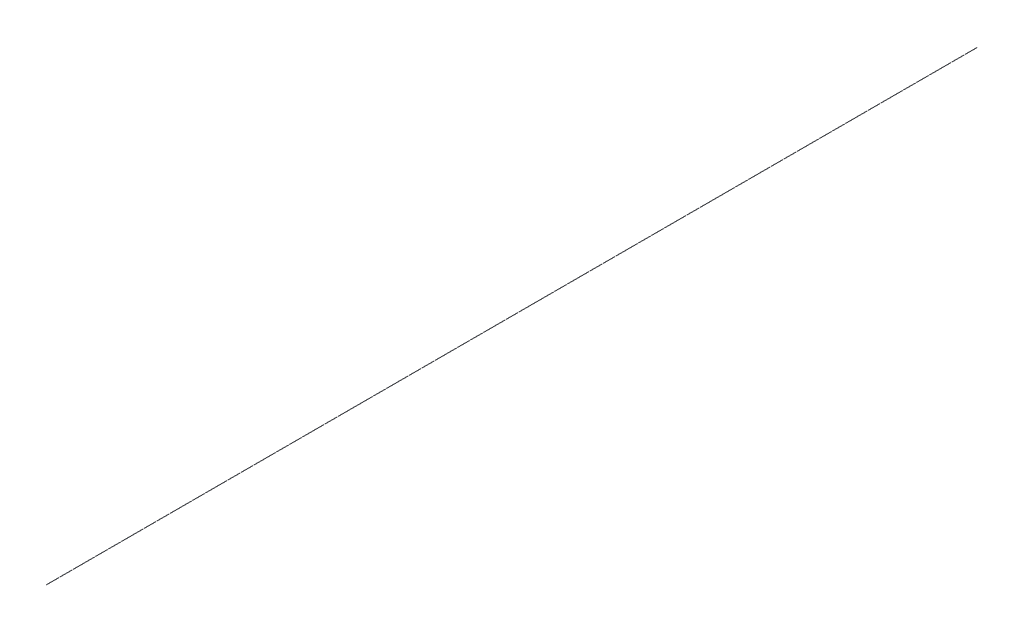
ISO-10303-21;
HEADER;
FILE_DESCRIPTION(('STEP AP214'),'2;1');
FILE_NAME('part.step','',(''),(''),'','','');
FILE_SCHEMA(('AUTOMOTIVE_DESIGN { 1 0 10303 214 1 1 1 1 }'));
ENDSEC;
DATA;
#1=APPLICATION_CONTEXT('core data for automotive mechanical design processes');
#2=APPLICATION_PROTOCOL_DEFINITION('international standard','automotive_design',2000,#1);
#3=PRODUCT_CONTEXT('',#1,'mechanical');
#4=PRODUCT('Part','Part','',(#3));
#5=PRODUCT_RELATED_PRODUCT_CATEGORY('part','',(#4));
#6=PRODUCT_DEFINITION_FORMATION('','',#4);
#7=PRODUCT_DEFINITION_CONTEXT('part definition',#1,'design');
#8=PRODUCT_DEFINITION('design','',#6,#7);
#9=PRODUCT_DEFINITION_SHAPE('','',#8);
#10=(LENGTH_UNIT() NAMED_UNIT(*) SI_UNIT(.MILLI.,.METRE.));
#11=(NAMED_UNIT(*) PLANE_ANGLE_UNIT() SI_UNIT($,.RADIAN.));
#12=(NAMED_UNIT(*) SI_UNIT($,.STERADIAN.) SOLID_ANGLE_UNIT());
#13=UNCERTAINTY_MEASURE_WITH_UNIT(LENGTH_MEASURE(1.E-05),#10,'distance_accuracy_value','');
#14=(GEOMETRIC_REPRESENTATION_CONTEXT(3) GLOBAL_UNCERTAINTY_ASSIGNED_CONTEXT((#13)) GLOBAL_UNIT_ASSIGNED_CONTEXT((#10,
#11,#12)) REPRESENTATION_CONTEXT('',''));
#15=CARTESIAN_POINT('',(0.,0.,0.));
#16=DIRECTION('',(0.,0.,1.));
#17=DIRECTION('',(1.,0.,0.));
#18=AXIS2_PLACEMENT_3D('',#15,#16,#17);
#19=CARTESIAN_POINT('',(0.,0.,55000.));
#20=DIRECTION('',(0.,0.,-1.));
#21=DIRECTION('',(-1.,0.,0.));
#22=AXIS2_PLACEMENT_3D('',#19,#20,#21);
#23=CYLINDRICAL_SURFACE('',#22,5.);
#24=CARTESIAN_POINT('',(0.,0.,55000.));
#25=DIRECTION('',(0.,0.,1.));
#26=DIRECTION('',(1.,0.,0.));
#27=AXIS2_PLACEMENT_3D('',#24,#25,#26);
#28=CIRCLE('',#27,5.);
#29=CARTESIAN_POINT('',(5.,0.,55000.));
#30=VERTEX_POINT('',#29);
#31=EDGE_CURVE('E10',#30,#30,#28,.T.);
#32=ORIENTED_EDGE('',*,*,#31,.F.);
#33=EDGE_LOOP('',(#32));
#34=FACE_BOUND('',#33,.T.);
#35=CARTESIAN_POINT('',(0.,0.,0.));
#36=DIRECTION('',(0.,0.,1.));
#37=DIRECTION('',(1.,0.,0.));
#38=AXIS2_PLACEMENT_3D('',#35,#36,#37);
#39=CIRCLE('',#38,5.);
#40=CARTESIAN_POINT('',(5.,0.,0.));
#41=VERTEX_POINT('',#40);
#42=EDGE_CURVE('E33',#41,#41,#39,.T.);
#43=ORIENTED_EDGE('',*,*,#42,.T.);
#44=EDGE_LOOP('',(#43));
#45=FACE_BOUND('',#44,.T.);
#46=ADVANCED_FACE('F30',(#34,#45),#23,.T.);
#47=CARTESIAN_POINT('',(0.,0.,55000.));
#48=DIRECTION('',(0.,0.,1.));
#49=DIRECTION('',(1.,0.,0.));
#50=AXIS2_PLACEMENT_3D('',#47,#48,#49);
#51=PLANE('',#50);
#52=ORIENTED_EDGE('',*,*,#31,.T.);
#53=EDGE_LOOP('',(#52));
#54=FACE_BOUND('',#53,.T.);
#55=ADVANCED_FACE('F45',(#54),#51,.T.);
#56=CARTESIAN_POINT('',(0.,0.,0.));
#57=DIRECTION('',(0.,0.,1.));
#58=DIRECTION('',(1.,0.,0.));
#59=AXIS2_PLACEMENT_3D('',#56,#57,#58);
#60=PLANE('',#59);
#61=ORIENTED_EDGE('',*,*,#42,.F.);
#62=EDGE_LOOP('',(#61));
#63=FACE_BOUND('',#62,.T.);
#64=ADVANCED_FACE('F43',(#63),#60,.F.);
#65=CLOSED_SHELL('',(#46,#55,#64));
#66=MANIFOLD_SOLID_BREP('B2',#65);
#67=ADVANCED_BREP_SHAPE_REPRESENTATION('',(#18,#66),#14);
#68=SHAPE_DEFINITION_REPRESENTATION(#9,#67);
ENDSEC;
END-ISO-10303-21;
